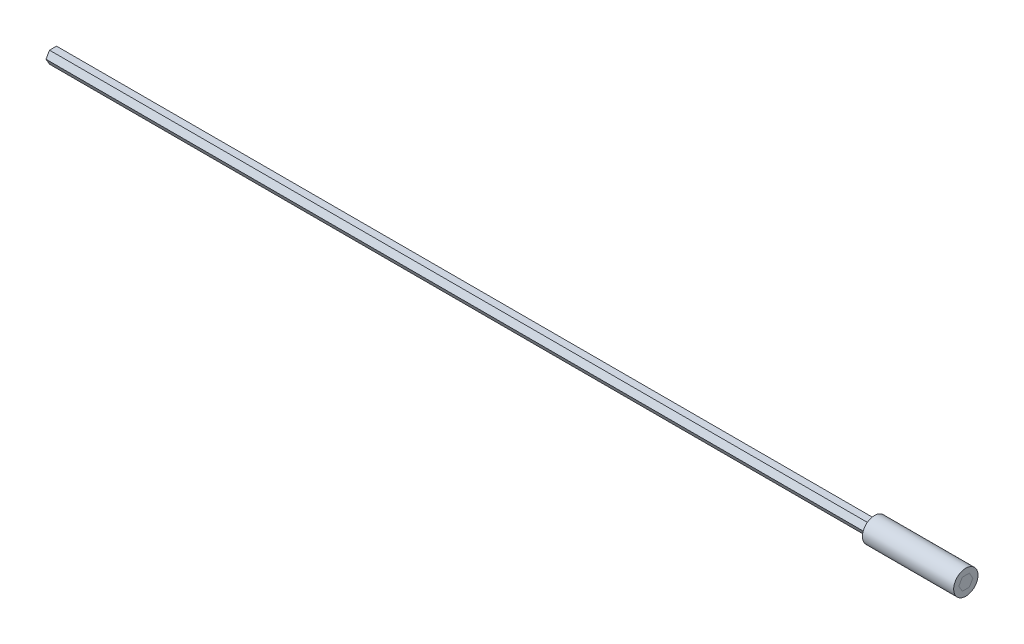
ISO-10303-21;
HEADER;
FILE_DESCRIPTION(('STEP AP214'),'2;1');
FILE_NAME('part.step','',(''),(''),'','','');
FILE_SCHEMA(('AUTOMOTIVE_DESIGN { 1 0 10303 214 1 1 1 1 }'));
ENDSEC;
DATA;
#1=APPLICATION_CONTEXT('core data for automotive mechanical design processes');
#2=APPLICATION_PROTOCOL_DEFINITION('international standard','automotive_design',2000,#1);
#3=PRODUCT_CONTEXT('',#1,'mechanical');
#4=PRODUCT('Part','Part','',(#3));
#5=PRODUCT_RELATED_PRODUCT_CATEGORY('part','',(#4));
#6=PRODUCT_DEFINITION_FORMATION('','',#4);
#7=PRODUCT_DEFINITION_CONTEXT('part definition',#1,'design');
#8=PRODUCT_DEFINITION('design','',#6,#7);
#9=PRODUCT_DEFINITION_SHAPE('','',#8);
#10=(LENGTH_UNIT() NAMED_UNIT(*) SI_UNIT(.MILLI.,.METRE.));
#11=(NAMED_UNIT(*) PLANE_ANGLE_UNIT() SI_UNIT($,.RADIAN.));
#12=(NAMED_UNIT(*) SI_UNIT($,.STERADIAN.) SOLID_ANGLE_UNIT());
#13=UNCERTAINTY_MEASURE_WITH_UNIT(LENGTH_MEASURE(1.E-05),#10,'distance_accuracy_value','');
#14=(GEOMETRIC_REPRESENTATION_CONTEXT(3) GLOBAL_UNCERTAINTY_ASSIGNED_CONTEXT((#13)) GLOBAL_UNIT_ASSIGNED_CONTEXT((#10,
#11,#12)) REPRESENTATION_CONTEXT('',''));
#15=CARTESIAN_POINT('',(0.,0.,0.));
#16=DIRECTION('',(0.,0.,1.));
#17=DIRECTION('',(1.,0.,0.));
#18=AXIS2_PLACEMENT_3D('',#15,#16,#17);
#19=CARTESIAN_POINT('',(60.,0.,0.));
#20=DIRECTION('',(1.,0.,0.));
#21=DIRECTION('',(0.,0.,-1.));
#22=AXIS2_PLACEMENT_3D('',#19,#20,#21);
#23=CYLINDRICAL_SURFACE('',#22,2.);
#24=CARTESIAN_POINT('',(60.,0.,0.));
#25=DIRECTION('',(1.,0.,0.));
#26=DIRECTION('',(0.,0.,-1.));
#27=AXIS2_PLACEMENT_3D('',#24,#25,#26);
#28=CIRCLE('',#27,2.);
#29=CARTESIAN_POINT('',(60.,0.,-2.));
#30=VERTEX_POINT('',#29);
#31=EDGE_CURVE('E12',#30,#30,#28,.T.);
#32=ORIENTED_EDGE('',*,*,#31,.T.);
#33=EDGE_LOOP('',(#32));
#34=FACE_BOUND('',#33,.T.);
#35=CARTESIAN_POINT('',(75.,0.,0.));
#36=DIRECTION('',(1.,0.,0.));
#37=DIRECTION('',(0.,0.,-1.));
#38=AXIS2_PLACEMENT_3D('',#35,#36,#37);
#39=CIRCLE('',#38,2.);
#40=CARTESIAN_POINT('',(75.,0.,-2.));
#41=VERTEX_POINT('',#40);
#42=EDGE_CURVE('E52',#41,#41,#39,.T.);
#43=ORIENTED_EDGE('',*,*,#42,.F.);
#44=EDGE_LOOP('',(#43));
#45=FACE_BOUND('',#44,.T.);
#46=ADVANCED_FACE('F49',(#34,#45),#23,.T.);
#47=CARTESIAN_POINT('',(60.,0.,0.));
#48=DIRECTION('',(1.,0.,0.));
#49=DIRECTION('',(0.,0.,-1.));
#50=AXIS2_PLACEMENT_3D('',#47,#48,#49);
#51=PLANE('',#50);
#52=DIRECTION('',(0.,-0.866025403784439,-0.5));
#53=VECTOR('',#52,1.);
#54=CARTESIAN_POINT('',(60.,0.,1.15470053837925));
#55=LINE('',#54,#53);
#56=CARTESIAN_POINT('',(60.,0.,1.15470053837925));
#57=VERTEX_POINT('',#56);
#58=CARTESIAN_POINT('',(60.,-1.,0.577350269189626));
#59=VERTEX_POINT('',#58);
#60=EDGE_CURVE('E109',#57,#59,#55,.T.);
#61=ORIENTED_EDGE('',*,*,#60,.T.);
#62=DIRECTION('',(0.,0.,-1.));
#63=VECTOR('',#62,1.);
#64=CARTESIAN_POINT('',(60.,-1.,0.577350269189626));
#65=LINE('',#64,#63);
#66=CARTESIAN_POINT('',(60.,-1.,-0.577350269189626));
#67=VERTEX_POINT('',#66);
#68=EDGE_CURVE('E103',#59,#67,#65,.T.);
#69=ORIENTED_EDGE('',*,*,#68,.T.);
#70=DIRECTION('',(0.,0.866025403784439,-0.5));
#71=VECTOR('',#70,1.);
#72=CARTESIAN_POINT('',(60.,-1.,-0.577350269189626));
#73=LINE('',#72,#71);
#74=CARTESIAN_POINT('',(60.,0.,-1.15470053837925));
#75=VERTEX_POINT('',#74);
#76=EDGE_CURVE('E112',#67,#75,#73,.T.);
#77=ORIENTED_EDGE('',*,*,#76,.T.);
#78=DIRECTION('',(0.,0.866025403784439,0.5));
#79=VECTOR('',#78,1.);
#80=CARTESIAN_POINT('',(60.,0.,-1.15470053837925));
#81=LINE('',#80,#79);
#82=CARTESIAN_POINT('',(60.,1.,-0.577350269189625));
#83=VERTEX_POINT('',#82);
#84=EDGE_CURVE('E63',#75,#83,#81,.T.);
#85=ORIENTED_EDGE('',*,*,#84,.T.);
#86=DIRECTION('',(0.,0.,1.));
#87=VECTOR('',#86,1.);
#88=CARTESIAN_POINT('',(60.,1.,-0.577350269189625));
#89=LINE('',#88,#87);
#90=CARTESIAN_POINT('',(60.,1.,0.577350269189626));
#91=VERTEX_POINT('',#90);
#92=EDGE_CURVE('E127',#83,#91,#89,.T.);
#93=ORIENTED_EDGE('',*,*,#92,.T.);
#94=DIRECTION('',(0.,-0.866025403784439,0.5));
#95=VECTOR('',#94,1.);
#96=CARTESIAN_POINT('',(60.,1.,0.577350269189626));
#97=LINE('',#96,#95);
#98=EDGE_CURVE('E130',#91,#57,#97,.T.);
#99=ORIENTED_EDGE('',*,*,#98,.T.);
#100=EDGE_LOOP('',(#61,#69,#77,#85,#93,#99));
#101=FACE_BOUND('',#100,.T.);
#102=ORIENTED_EDGE('',*,*,#31,.F.);
#103=EDGE_LOOP('',(#102));
#104=FACE_BOUND('',#103,.T.);
#105=ADVANCED_FACE('F116',(#101,#104),#51,.F.);
#106=CARTESIAN_POINT('',(75.,0.,0.));
#107=DIRECTION('',(1.,0.,0.));
#108=DIRECTION('',(0.,0.,-1.));
#109=AXIS2_PLACEMENT_3D('',#106,#107,#108);
#110=PLANE('',#109);
#111=DIRECTION('',(0.,0.,-1.));
#112=VECTOR('',#111,1.);
#113=CARTESIAN_POINT('',(75.,-1.,0.577350269189626));
#114=LINE('',#113,#112);
#115=CARTESIAN_POINT('',(75.,-1.,0.577350269189626));
#116=VERTEX_POINT('',#115);
#117=CARTESIAN_POINT('',(75.,-1.,-0.577350269189626));
#118=VERTEX_POINT('',#117);
#119=EDGE_CURVE('E71',#116,#118,#114,.T.);
#120=ORIENTED_EDGE('',*,*,#119,.F.);
#121=DIRECTION('',(0.,-0.866025403784439,-0.5));
#122=VECTOR('',#121,1.);
#123=CARTESIAN_POINT('',(75.,0.,1.15470053837925));
#124=LINE('',#123,#122);
#125=CARTESIAN_POINT('',(75.,0.,1.15470053837925));
#126=VERTEX_POINT('',#125);
#127=EDGE_CURVE('E120',#126,#116,#124,.T.);
#128=ORIENTED_EDGE('',*,*,#127,.F.);
#129=DIRECTION('',(0.,-0.866025403784439,0.5));
#130=VECTOR('',#129,1.);
#131=CARTESIAN_POINT('',(75.,1.,0.577350269189626));
#132=LINE('',#131,#130);
#133=CARTESIAN_POINT('',(75.,1.,0.577350269189626));
#134=VERTEX_POINT('',#133);
#135=EDGE_CURVE('E123',#134,#126,#132,.T.);
#136=ORIENTED_EDGE('',*,*,#135,.F.);
#137=DIRECTION('',(0.,0.,1.));
#138=VECTOR('',#137,1.);
#139=CARTESIAN_POINT('',(75.,1.,-0.577350269189625));
#140=LINE('',#139,#138);
#141=CARTESIAN_POINT('',(75.,1.,-0.577350269189625));
#142=VERTEX_POINT('',#141);
#143=EDGE_CURVE('E139',#142,#134,#140,.T.);
#144=ORIENTED_EDGE('',*,*,#143,.F.);
#145=DIRECTION('',(0.,0.866025403784439,0.5));
#146=VECTOR('',#145,1.);
#147=CARTESIAN_POINT('',(75.,0.,-1.15470053837925));
#148=LINE('',#147,#146);
#149=CARTESIAN_POINT('',(75.,0.,-1.15470053837925));
#150=VERTEX_POINT('',#149);
#151=EDGE_CURVE('E136',#150,#142,#148,.T.);
#152=ORIENTED_EDGE('',*,*,#151,.F.);
#153=DIRECTION('',(0.,0.866025403784439,-0.5));
#154=VECTOR('',#153,1.);
#155=CARTESIAN_POINT('',(75.,-1.,-0.577350269189626));
#156=LINE('',#155,#154);
#157=EDGE_CURVE('E134',#118,#150,#156,.T.);
#158=ORIENTED_EDGE('',*,*,#157,.F.);
#159=EDGE_LOOP('',(#120,#128,#136,#144,#152,#158));
#160=FACE_BOUND('',#159,.T.);
#161=ORIENTED_EDGE('',*,*,#42,.T.);
#162=EDGE_LOOP('',(#161));
#163=FACE_BOUND('',#162,.T.);
#164=ADVANCED_FACE('F156',(#160,#163),#110,.T.);
#165=CARTESIAN_POINT('',(60.,-1.,0.577350269189626));
#166=DIRECTION('',(0.,-1.,0.));
#167=DIRECTION('',(0.,0.,-1.));
#168=AXIS2_PLACEMENT_3D('',#165,#166,#167);
#169=PLANE('',#168);
#170=ORIENTED_EDGE('',*,*,#119,.T.);
#171=DIRECTION('',(1.,0.,0.));
#172=VECTOR('',#171,1.);
#173=CARTESIAN_POINT('',(60.,-1.,-0.577350269189626));
#174=LINE('',#173,#172);
#175=EDGE_CURVE('E99',#67,#118,#174,.T.);
#176=ORIENTED_EDGE('',*,*,#175,.F.);
#177=ORIENTED_EDGE('',*,*,#68,.F.);
#178=DIRECTION('',(1.,0.,0.));
#179=VECTOR('',#178,1.);
#180=CARTESIAN_POINT('',(60.,-1.,0.577350269189626));
#181=LINE('',#180,#179);
#182=EDGE_CURVE('E144',#59,#116,#181,.T.);
#183=ORIENTED_EDGE('',*,*,#182,.T.);
#184=EDGE_LOOP('',(#170,#176,#177,#183));
#185=FACE_BOUND('',#184,.T.);
#186=ADVANCED_FACE('F101',(#185),#169,.F.);
#187=CARTESIAN_POINT('',(60.,0.,1.15470053837925));
#188=DIRECTION('',(0.,-0.5,0.866025403784439));
#189=DIRECTION('',(0.,-0.866025403784439,-0.5));
#190=AXIS2_PLACEMENT_3D('',#187,#188,#189);
#191=PLANE('',#190);
#192=ORIENTED_EDGE('',*,*,#127,.T.);
#193=ORIENTED_EDGE('',*,*,#182,.F.);
#194=ORIENTED_EDGE('',*,*,#60,.F.);
#195=DIRECTION('',(1.,0.,0.));
#196=VECTOR('',#195,1.);
#197=CARTESIAN_POINT('',(60.,0.,1.15470053837925));
#198=LINE('',#197,#196);
#199=EDGE_CURVE('E146',#57,#126,#198,.T.);
#200=ORIENTED_EDGE('',*,*,#199,.T.);
#201=EDGE_LOOP('',(#192,#193,#194,#200));
#202=FACE_BOUND('',#201,.T.);
#203=ADVANCED_FACE('F167',(#202),#191,.F.);
#204=CARTESIAN_POINT('',(60.,1.,0.577350269189626));
#205=DIRECTION('',(0.,0.5,0.866025403784439));
#206=DIRECTION('',(0.,-0.866025403784439,0.5));
#207=AXIS2_PLACEMENT_3D('',#204,#205,#206);
#208=PLANE('',#207);
#209=ORIENTED_EDGE('',*,*,#135,.T.);
#210=ORIENTED_EDGE('',*,*,#199,.F.);
#211=ORIENTED_EDGE('',*,*,#98,.F.);
#212=DIRECTION('',(1.,0.,0.));
#213=VECTOR('',#212,1.);
#214=CARTESIAN_POINT('',(60.,1.,0.577350269189626));
#215=LINE('',#214,#213);
#216=EDGE_CURVE('E148',#91,#134,#215,.T.);
#217=ORIENTED_EDGE('',*,*,#216,.T.);
#218=EDGE_LOOP('',(#209,#210,#211,#217));
#219=FACE_BOUND('',#218,.T.);
#220=ADVANCED_FACE('F165',(#219),#208,.F.);
#221=CARTESIAN_POINT('',(60.,1.,-0.577350269189625));
#222=DIRECTION('',(0.,1.,0.));
#223=DIRECTION('',(0.,0.,1.));
#224=AXIS2_PLACEMENT_3D('',#221,#222,#223);
#225=PLANE('',#224);
#226=ORIENTED_EDGE('',*,*,#143,.T.);
#227=ORIENTED_EDGE('',*,*,#216,.F.);
#228=ORIENTED_EDGE('',*,*,#92,.F.);
#229=DIRECTION('',(1.,0.,0.));
#230=VECTOR('',#229,1.);
#231=CARTESIAN_POINT('',(60.,1.,-0.577350269189625));
#232=LINE('',#231,#230);
#233=EDGE_CURVE('E150',#83,#142,#232,.T.);
#234=ORIENTED_EDGE('',*,*,#233,.T.);
#235=EDGE_LOOP('',(#226,#227,#228,#234));
#236=FACE_BOUND('',#235,.T.);
#237=ADVANCED_FACE('F161',(#236),#225,.F.);
#238=CARTESIAN_POINT('',(60.,0.,-1.15470053837925));
#239=DIRECTION('',(0.,0.5,-0.866025403784439));
#240=DIRECTION('',(0.,0.866025403784439,0.5));
#241=AXIS2_PLACEMENT_3D('',#238,#239,#240);
#242=PLANE('',#241);
#243=ORIENTED_EDGE('',*,*,#151,.T.);
#244=ORIENTED_EDGE('',*,*,#233,.F.);
#245=ORIENTED_EDGE('',*,*,#84,.F.);
#246=DIRECTION('',(1.,0.,0.));
#247=VECTOR('',#246,1.);
#248=CARTESIAN_POINT('',(60.,0.,-1.15470053837925));
#249=LINE('',#248,#247);
#250=EDGE_CURVE('E108',#75,#150,#249,.T.);
#251=ORIENTED_EDGE('',*,*,#250,.T.);
#252=EDGE_LOOP('',(#243,#244,#245,#251));
#253=FACE_BOUND('',#252,.T.);
#254=ADVANCED_FACE('F152',(#253),#242,.F.);
#255=CARTESIAN_POINT('',(60.,-1.,-0.577350269189626));
#256=DIRECTION('',(0.,-0.5,-0.866025403784439));
#257=DIRECTION('',(0.,0.866025403784439,-0.5));
#258=AXIS2_PLACEMENT_3D('',#255,#256,#257);
#259=PLANE('',#258);
#260=ORIENTED_EDGE('',*,*,#157,.T.);
#261=ORIENTED_EDGE('',*,*,#250,.F.);
#262=ORIENTED_EDGE('',*,*,#76,.F.);
#263=ORIENTED_EDGE('',*,*,#175,.T.);
#264=EDGE_LOOP('',(#260,#261,#262,#263));
#265=FACE_BOUND('',#264,.T.);
#266=ADVANCED_FACE('F113',(#265),#259,.F.);
#267=CLOSED_SHELL('',(#46,#105,#164,#186,#203,#220,#237,#254,#266));
#268=MANIFOLD_SOLID_BREP('B2',#267);
#269=CARTESIAN_POINT('',(75.,-1.,-0.577350269189626));
#270=DIRECTION('',(0.,0.5,0.866025403784439));
#271=DIRECTION('',(0.,-0.866025403784439,0.5));
#272=AXIS2_PLACEMENT_3D('',#269,#270,#271);
#273=PLANE('',#272);
#274=DIRECTION('',(0.,0.866025403784439,-0.5));
#275=VECTOR('',#274,1.);
#276=CARTESIAN_POINT('',(-75.,-1.,-0.577350269189626));
#277=LINE('',#276,#275);
#278=CARTESIAN_POINT('',(-75.,-1.,-0.577350269189626));
#279=VERTEX_POINT('',#278);
#280=CARTESIAN_POINT('',(-75.,0.,-1.15470053837925));
#281=VERTEX_POINT('',#280);
#282=EDGE_CURVE('E335',#279,#281,#277,.T.);
#283=ORIENTED_EDGE('',*,*,#282,.T.);
#284=DIRECTION('',(-1.,0.,0.));
#285=VECTOR('',#284,1.);
#286=CARTESIAN_POINT('',(75.,0.,-1.15470053837925));
#287=LINE('',#286,#285);
#288=CARTESIAN_POINT('',(75.,0.,-1.15470053837925));
#289=VERTEX_POINT('',#288);
#290=EDGE_CURVE('E47',#289,#281,#287,.T.);
#291=ORIENTED_EDGE('',*,*,#290,.F.);
#292=DIRECTION('',(0.,0.866025403784439,-0.5));
#293=VECTOR('',#292,1.);
#294=CARTESIAN_POINT('',(75.,-1.,-0.577350269189626));
#295=LINE('',#294,#293);
#296=CARTESIAN_POINT('',(75.,-1.,-0.577350269189626));
#297=VERTEX_POINT('',#296);
#298=EDGE_CURVE('E351',#297,#289,#295,.T.);
#299=ORIENTED_EDGE('',*,*,#298,.F.);
#300=DIRECTION('',(-1.,0.,0.));
#301=VECTOR('',#300,1.);
#302=CARTESIAN_POINT('',(75.,-1.,-0.577350269189626));
#303=LINE('',#302,#301);
#304=EDGE_CURVE('E331',#297,#279,#303,.T.);
#305=ORIENTED_EDGE('',*,*,#304,.T.);
#306=EDGE_LOOP('',(#283,#291,#299,#305));
#307=FACE_BOUND('',#306,.T.);
#308=ADVANCED_FACE('F246',(#307),#273,.F.);
#309=CARTESIAN_POINT('',(75.,0.,-1.15470053837925));
#310=DIRECTION('',(0.,-0.5,0.866025403784439));
#311=DIRECTION('',(0.,-0.866025403784439,-0.5));
#312=AXIS2_PLACEMENT_3D('',#309,#310,#311);
#313=PLANE('',#312);
#314=DIRECTION('',(0.,0.866025403784439,0.5));
#315=VECTOR('',#314,1.);
#316=CARTESIAN_POINT('',(-75.,0.,-1.15470053837925));
#317=LINE('',#316,#315);
#318=CARTESIAN_POINT('',(-75.,1.,-0.577350269189625));
#319=VERTEX_POINT('',#318);
#320=EDGE_CURVE('E339',#281,#319,#317,.T.);
#321=ORIENTED_EDGE('',*,*,#320,.T.);
#322=DIRECTION('',(-1.,0.,0.));
#323=VECTOR('',#322,1.);
#324=CARTESIAN_POINT('',(75.,1.,-0.577350269189625));
#325=LINE('',#324,#323);
#326=CARTESIAN_POINT('',(75.,1.,-0.577350269189625));
#327=VERTEX_POINT('',#326);
#328=EDGE_CURVE('E255',#327,#319,#325,.T.);
#329=ORIENTED_EDGE('',*,*,#328,.F.);
#330=DIRECTION('',(0.,0.866025403784439,0.5));
#331=VECTOR('',#330,1.);
#332=CARTESIAN_POINT('',(75.,0.,-1.15470053837925));
#333=LINE('',#332,#331);
#334=EDGE_CURVE('E300',#289,#327,#333,.T.);
#335=ORIENTED_EDGE('',*,*,#334,.F.);
#336=ORIENTED_EDGE('',*,*,#290,.T.);
#337=EDGE_LOOP('',(#321,#329,#335,#336));
#338=FACE_BOUND('',#337,.T.);
#339=ADVANCED_FACE('F379',(#338),#313,.F.);
#340=CARTESIAN_POINT('',(75.,1.,-0.577350269189625));
#341=DIRECTION('',(0.,-1.,0.));
#342=DIRECTION('',(0.,0.,-1.));
#343=AXIS2_PLACEMENT_3D('',#340,#341,#342);
#344=PLANE('',#343);
#345=DIRECTION('',(0.,0.,1.));
#346=VECTOR('',#345,1.);
#347=CARTESIAN_POINT('',(-75.,1.,-0.577350269189625));
#348=LINE('',#347,#346);
#349=CARTESIAN_POINT('',(-75.,1.,0.577350269189626));
#350=VERTEX_POINT('',#349);
#351=EDGE_CURVE('E342',#319,#350,#348,.T.);
#352=ORIENTED_EDGE('',*,*,#351,.T.);
#353=DIRECTION('',(-1.,0.,0.));
#354=VECTOR('',#353,1.);
#355=CARTESIAN_POINT('',(75.,1.,0.577350269189626));
#356=LINE('',#355,#354);
#357=CARTESIAN_POINT('',(75.,1.,0.577350269189626));
#358=VERTEX_POINT('',#357);
#359=EDGE_CURVE('E324',#358,#350,#356,.T.);
#360=ORIENTED_EDGE('',*,*,#359,.F.);
#361=DIRECTION('',(0.,0.,1.));
#362=VECTOR('',#361,1.);
#363=CARTESIAN_POINT('',(75.,1.,-0.577350269189625));
#364=LINE('',#363,#362);
#365=EDGE_CURVE('E313',#327,#358,#364,.T.);
#366=ORIENTED_EDGE('',*,*,#365,.F.);
#367=ORIENTED_EDGE('',*,*,#328,.T.);
#368=EDGE_LOOP('',(#352,#360,#366,#367));
#369=FACE_BOUND('',#368,.T.);
#370=ADVANCED_FACE('F361',(#369),#344,.F.);
#371=CARTESIAN_POINT('',(75.,1.,0.577350269189626));
#372=DIRECTION('',(0.,-0.5,-0.866025403784439));
#373=DIRECTION('',(0.,0.866025403784439,-0.5));
#374=AXIS2_PLACEMENT_3D('',#371,#372,#373);
#375=PLANE('',#374);
#376=DIRECTION('',(0.,-0.866025403784439,0.5));
#377=VECTOR('',#376,1.);
#378=CARTESIAN_POINT('',(-75.,1.,0.577350269189626));
#379=LINE('',#378,#377);
#380=CARTESIAN_POINT('',(-75.,0.,1.15470053837925));
#381=VERTEX_POINT('',#380);
#382=EDGE_CURVE('E322',#350,#381,#379,.T.);
#383=ORIENTED_EDGE('',*,*,#382,.T.);
#384=DIRECTION('',(-1.,0.,0.));
#385=VECTOR('',#384,1.);
#386=CARTESIAN_POINT('',(75.,0.,1.15470053837925));
#387=LINE('',#386,#385);
#388=CARTESIAN_POINT('',(75.,0.,1.15470053837925));
#389=VERTEX_POINT('',#388);
#390=EDGE_CURVE('E319',#389,#381,#387,.T.);
#391=ORIENTED_EDGE('',*,*,#390,.F.);
#392=DIRECTION('',(0.,-0.866025403784439,0.5));
#393=VECTOR('',#392,1.);
#394=CARTESIAN_POINT('',(75.,1.,0.577350269189626));
#395=LINE('',#394,#393);
#396=EDGE_CURVE('E307',#358,#389,#395,.T.);
#397=ORIENTED_EDGE('',*,*,#396,.F.);
#398=ORIENTED_EDGE('',*,*,#359,.T.);
#399=EDGE_LOOP('',(#383,#391,#397,#398));
#400=FACE_BOUND('',#399,.T.);
#401=ADVANCED_FACE('F320',(#400),#375,.F.);
#402=CARTESIAN_POINT('',(75.,0.,1.15470053837925));
#403=DIRECTION('',(0.,0.5,-0.866025403784439));
#404=DIRECTION('',(0.,0.866025403784439,0.5));
#405=AXIS2_PLACEMENT_3D('',#402,#403,#404);
#406=PLANE('',#405);
#407=DIRECTION('',(0.,-0.866025403784439,-0.5));
#408=VECTOR('',#407,1.);
#409=CARTESIAN_POINT('',(-75.,0.,1.15470053837925));
#410=LINE('',#409,#408);
#411=CARTESIAN_POINT('',(-75.,-1.,0.577350269189626));
#412=VERTEX_POINT('',#411);
#413=EDGE_CURVE('E286',#381,#412,#410,.T.);
#414=ORIENTED_EDGE('',*,*,#413,.T.);
#415=DIRECTION('',(-1.,0.,0.));
#416=VECTOR('',#415,1.);
#417=CARTESIAN_POINT('',(75.,-1.,0.577350269189626));
#418=LINE('',#417,#416);
#419=CARTESIAN_POINT('',(75.,-1.,0.577350269189626));
#420=VERTEX_POINT('',#419);
#421=EDGE_CURVE('E325',#420,#412,#418,.T.);
#422=ORIENTED_EDGE('',*,*,#421,.F.);
#423=DIRECTION('',(0.,-0.866025403784439,-0.5));
#424=VECTOR('',#423,1.);
#425=CARTESIAN_POINT('',(75.,0.,1.15470053837925));
#426=LINE('',#425,#424);
#427=EDGE_CURVE('E311',#389,#420,#426,.T.);
#428=ORIENTED_EDGE('',*,*,#427,.F.);
#429=ORIENTED_EDGE('',*,*,#390,.T.);
#430=EDGE_LOOP('',(#414,#422,#428,#429));
#431=FACE_BOUND('',#430,.T.);
#432=ADVANCED_FACE('F327',(#431),#406,.F.);
#433=CARTESIAN_POINT('',(75.,-1.,0.577350269189626));
#434=DIRECTION('',(0.,1.,0.));
#435=DIRECTION('',(0.,0.,1.));
#436=AXIS2_PLACEMENT_3D('',#433,#434,#435);
#437=PLANE('',#436);
#438=DIRECTION('',(0.,0.,-1.));
#439=VECTOR('',#438,1.);
#440=CARTESIAN_POINT('',(-75.,-1.,0.577350269189626));
#441=LINE('',#440,#439);
#442=EDGE_CURVE('E292',#412,#279,#441,.T.);
#443=ORIENTED_EDGE('',*,*,#442,.T.);
#444=ORIENTED_EDGE('',*,*,#304,.F.);
#445=DIRECTION('',(0.,0.,-1.));
#446=VECTOR('',#445,1.);
#447=CARTESIAN_POINT('',(75.,-1.,0.577350269189626));
#448=LINE('',#447,#446);
#449=EDGE_CURVE('E263',#420,#297,#448,.T.);
#450=ORIENTED_EDGE('',*,*,#449,.F.);
#451=ORIENTED_EDGE('',*,*,#421,.T.);
#452=EDGE_LOOP('',(#443,#444,#450,#451));
#453=FACE_BOUND('',#452,.T.);
#454=ADVANCED_FACE('F368',(#453),#437,.F.);
#455=CARTESIAN_POINT('',(75.,0.,0.));
#456=DIRECTION('',(1.,0.,0.));
#457=DIRECTION('',(0.,0.,-1.));
#458=AXIS2_PLACEMENT_3D('',#455,#456,#457);
#459=PLANE('',#458);
#460=ORIENTED_EDGE('',*,*,#298,.T.);
#461=ORIENTED_EDGE('',*,*,#334,.T.);
#462=ORIENTED_EDGE('',*,*,#365,.T.);
#463=ORIENTED_EDGE('',*,*,#396,.T.);
#464=ORIENTED_EDGE('',*,*,#427,.T.);
#465=ORIENTED_EDGE('',*,*,#449,.T.);
#466=EDGE_LOOP('',(#460,#461,#462,#463,#464,#465));
#467=FACE_BOUND('',#466,.T.);
#468=ADVANCED_FACE('F309',(#467),#459,.T.);
#469=CARTESIAN_POINT('',(-75.,0.,0.));
#470=DIRECTION('',(1.,0.,0.));
#471=DIRECTION('',(0.,0.,-1.));
#472=AXIS2_PLACEMENT_3D('',#469,#470,#471);
#473=PLANE('',#472);
#474=ORIENTED_EDGE('',*,*,#282,.F.);
#475=ORIENTED_EDGE('',*,*,#442,.F.);
#476=ORIENTED_EDGE('',*,*,#413,.F.);
#477=ORIENTED_EDGE('',*,*,#382,.F.);
#478=ORIENTED_EDGE('',*,*,#351,.F.);
#479=ORIENTED_EDGE('',*,*,#320,.F.);
#480=EDGE_LOOP('',(#474,#475,#476,#477,#478,#479));
#481=FACE_BOUND('',#480,.T.);
#482=ADVANCED_FACE('F364',(#481),#473,.F.);
#483=CLOSED_SHELL('',(#308,#339,#370,#401,#432,#454,#468,#482));
#484=MANIFOLD_SOLID_BREP('B6',#483);
#485=ADVANCED_BREP_SHAPE_REPRESENTATION('',(#18,#268,#484),#14);
#486=SHAPE_DEFINITION_REPRESENTATION(#9,#485);
ENDSEC;
END-ISO-10303-21;
